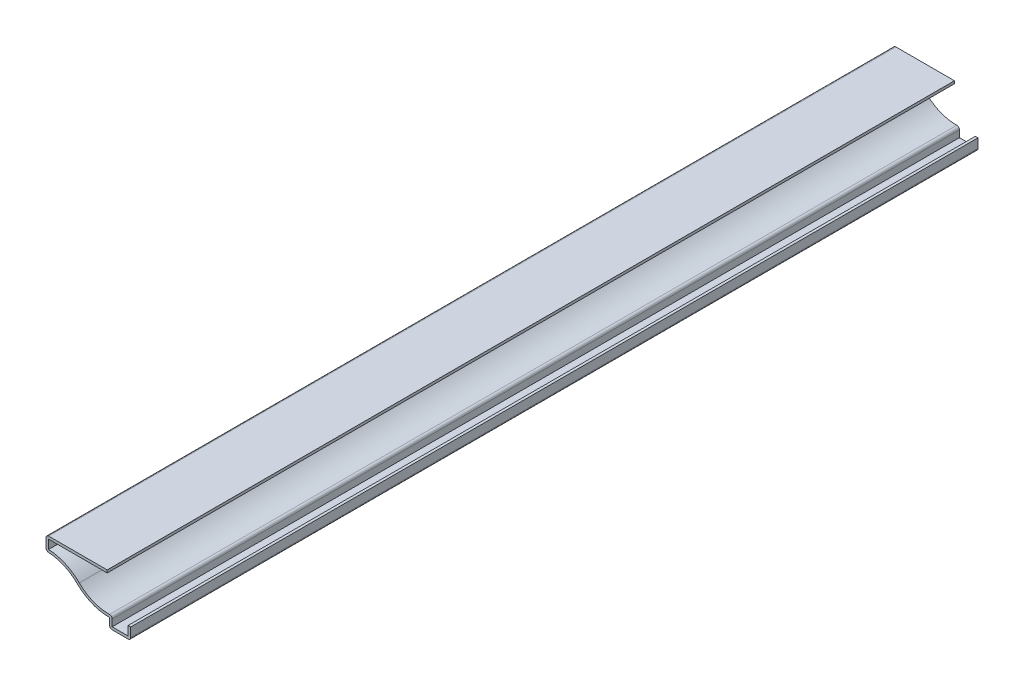
ISO-10303-21;
HEADER;
FILE_DESCRIPTION(('STEP AP214'),'2;1');
FILE_NAME('part.step','',(''),(''),'','','');
FILE_SCHEMA(('AUTOMOTIVE_DESIGN { 1 0 10303 214 1 1 1 1 }'));
ENDSEC;
DATA;
#1=APPLICATION_CONTEXT('core data for automotive mechanical design processes');
#2=APPLICATION_PROTOCOL_DEFINITION('international standard','automotive_design',2000,#1);
#3=PRODUCT_CONTEXT('',#1,'mechanical');
#4=PRODUCT('Part','Part','',(#3));
#5=PRODUCT_RELATED_PRODUCT_CATEGORY('part','',(#4));
#6=PRODUCT_DEFINITION_FORMATION('','',#4);
#7=PRODUCT_DEFINITION_CONTEXT('part definition',#1,'design');
#8=PRODUCT_DEFINITION('design','',#6,#7);
#9=PRODUCT_DEFINITION_SHAPE('','',#8);
#10=(LENGTH_UNIT() NAMED_UNIT(*) SI_UNIT(.MILLI.,.METRE.));
#11=(NAMED_UNIT(*) PLANE_ANGLE_UNIT() SI_UNIT($,.RADIAN.));
#12=(NAMED_UNIT(*) SI_UNIT($,.STERADIAN.) SOLID_ANGLE_UNIT());
#13=UNCERTAINTY_MEASURE_WITH_UNIT(LENGTH_MEASURE(1.E-05),#10,'distance_accuracy_value','');
#14=(GEOMETRIC_REPRESENTATION_CONTEXT(3) GLOBAL_UNCERTAINTY_ASSIGNED_CONTEXT((#13)) GLOBAL_UNIT_ASSIGNED_CONTEXT((#10,
#11,#12)) REPRESENTATION_CONTEXT('',''));
#15=CARTESIAN_POINT('',(0.,0.,0.));
#16=DIRECTION('',(0.,0.,1.));
#17=DIRECTION('',(1.,0.,0.));
#18=AXIS2_PLACEMENT_3D('',#15,#16,#17);
#19=CARTESIAN_POINT('',(-28.575,15.77975,-285.75));
#20=DIRECTION('',(0.,-1.,0.));
#21=DIRECTION('',(1.,0.,0.));
#22=AXIS2_PLACEMENT_3D('',#19,#20,#21);
#23=PLANE('',#22);
#24=DIRECTION('',(1.,0.,0.));
#25=VECTOR('',#24,1.);
#26=CARTESIAN_POINT('',(-28.575,15.77975,0.));
#27=LINE('',#26,#25);
#28=CARTESIAN_POINT('',(-27.686,15.77975,0.));
#29=VERTEX_POINT('',#28);
#30=CARTESIAN_POINT('',(-7.9375,15.77975,0.));
#31=VERTEX_POINT('',#30);
#32=EDGE_CURVE('E242',#29,#31,#27,.T.);
#33=ORIENTED_EDGE('',*,*,#32,.F.);
#34=DIRECTION('',(0.,0.,1.));
#35=VECTOR('',#34,1.);
#36=CARTESIAN_POINT('',(-27.686,15.77975,-285.75));
#37=LINE('',#36,#35);
#38=CARTESIAN_POINT('',(-27.686,15.77975,-285.75));
#39=VERTEX_POINT('',#38);
#40=EDGE_CURVE('E203',#39,#29,#37,.T.);
#41=ORIENTED_EDGE('',*,*,#40,.F.);
#42=DIRECTION('',(1.,0.,0.));
#43=VECTOR('',#42,1.);
#44=CARTESIAN_POINT('',(-28.575,15.77975,-285.75));
#45=LINE('',#44,#43);
#46=CARTESIAN_POINT('',(-7.9375,15.77975,-285.75));
#47=VERTEX_POINT('',#46);
#48=EDGE_CURVE('E185',#39,#47,#45,.T.);
#49=ORIENTED_EDGE('',*,*,#48,.T.);
#50=DIRECTION('',(0.,0.,1.));
#51=VECTOR('',#50,1.);
#52=CARTESIAN_POINT('',(-7.9375,15.77975,-285.75));
#53=LINE('',#52,#51);
#54=EDGE_CURVE('E193',#47,#31,#53,.T.);
#55=ORIENTED_EDGE('',*,*,#54,.T.);
#56=EDGE_LOOP('',(#33,#41,#49,#55));
#57=FACE_BOUND('',#56,.T.);
#58=ADVANCED_FACE('F35',(#57),#23,.T.);
#59=CARTESIAN_POINT('',(-27.686,16.66875,-285.75));
#60=DIRECTION('',(1.,0.,0.));
#61=DIRECTION('',(0.,0.,-1.));
#62=AXIS2_PLACEMENT_3D('',#59,#60,#61);
#63=PLANE('',#62);
#64=DIRECTION('',(0.,1.,0.));
#65=VECTOR('',#64,1.);
#66=CARTESIAN_POINT('',(-27.686,16.66875,0.));
#67=LINE('',#66,#65);
#68=CARTESIAN_POINT('',(-27.686,12.770487263251,0.));
#69=VERTEX_POINT('',#68);
#70=EDGE_CURVE('E204',#69,#29,#67,.T.);
#71=ORIENTED_EDGE('',*,*,#70,.F.);
#72=DIRECTION('',(0.,0.,1.));
#73=VECTOR('',#72,1.);
#74=CARTESIAN_POINT('',(-27.686,12.770487263251,-285.75));
#75=LINE('',#74,#73);
#76=CARTESIAN_POINT('',(-27.686,12.770487263251,-285.75));
#77=VERTEX_POINT('',#76);
#78=EDGE_CURVE('E279',#77,#69,#75,.T.);
#79=ORIENTED_EDGE('',*,*,#78,.F.);
#80=DIRECTION('',(0.,1.,0.));
#81=VECTOR('',#80,1.);
#82=CARTESIAN_POINT('',(-27.686,16.66875,-285.75));
#83=LINE('',#82,#81);
#84=EDGE_CURVE('E201',#77,#39,#83,.T.);
#85=ORIENTED_EDGE('',*,*,#84,.T.);
#86=ORIENTED_EDGE('',*,*,#40,.T.);
#87=EDGE_LOOP('',(#71,#79,#85,#86));
#88=FACE_BOUND('',#87,.T.);
#89=ADVANCED_FACE('F360',(#88),#63,.T.);
#90=CARTESIAN_POINT('',(-28.575,-3.175,-285.75));
#91=DIRECTION('',(0.,0.,1.));
#92=DIRECTION('',(1.,0.,0.));
#93=AXIS2_PLACEMENT_3D('',#90,#91,#92);
#94=CYLINDRICAL_SURFACE('',#93,15.97025);
#95=CARTESIAN_POINT('',(-28.575,-3.175,0.));
#96=DIRECTION('',(0.,0.,1.));
#97=DIRECTION('',(1.,0.,0.));
#98=AXIS2_PLACEMENT_3D('',#95,#96,#97);
#99=CIRCLE('',#98,15.97025);
#100=CARTESIAN_POINT('',(-17.3364565399886,8.1715424671983,0.));
#101=VERTEX_POINT('',#100);
#102=EDGE_CURVE('E207',#101,#69,#99,.T.);
#103=ORIENTED_EDGE('',*,*,#102,.F.);
#104=DIRECTION('',(0.,0.,1.));
#105=VECTOR('',#104,1.);
#106=CARTESIAN_POINT('',(-17.3364565399886,8.1715424671983,-285.75));
#107=LINE('',#106,#105);
#108=CARTESIAN_POINT('',(-17.3364565399886,8.1715424671983,-285.75));
#109=VERTEX_POINT('',#108);
#110=EDGE_CURVE('E281',#109,#101,#107,.T.);
#111=ORIENTED_EDGE('',*,*,#110,.F.);
#112=CARTESIAN_POINT('',(-28.575,-3.175,-285.75));
#113=DIRECTION('',(0.,0.,1.));
#114=DIRECTION('',(1.,0.,0.));
#115=AXIS2_PLACEMENT_3D('',#112,#113,#114);
#116=CIRCLE('',#115,15.97025);
#117=EDGE_CURVE('E238',#109,#77,#116,.T.);
#118=ORIENTED_EDGE('',*,*,#117,.T.);
#119=ORIENTED_EDGE('',*,*,#78,.T.);
#120=EDGE_LOOP('',(#103,#111,#118,#119));
#121=FACE_BOUND('',#120,.T.);
#122=ADVANCED_FACE('F366',(#121),#94,.T.);
#123=CARTESIAN_POINT('',(-7.34912268983927,18.2548515782075,-285.75));
#124=DIRECTION('',(0.,0.,1.));
#125=DIRECTION('',(1.,0.,0.));
#126=AXIS2_PLACEMENT_3D('',#123,#124,#125);
#127=CYLINDRICAL_SURFACE('',#126,14.19225);
#128=CARTESIAN_POINT('',(-7.34912268983927,18.2548515782075,0.));
#129=DIRECTION('',(0.,0.,1.));
#130=DIRECTION('',(1.,0.,0.));
#131=AXIS2_PLACEMENT_3D('',#128,#129,#130);
#132=CIRCLE('',#131,14.19225);
#133=CARTESIAN_POINT('',(-7.15585617961158,4.06391756671539,0.));
#134=VERTEX_POINT('',#133);
#135=EDGE_CURVE('E273',#134,#101,#132,.F.);
#136=ORIENTED_EDGE('',*,*,#135,.F.);
#137=DIRECTION('',(0.,0.,1.));
#138=VECTOR('',#137,1.);
#139=CARTESIAN_POINT('',(-7.15585617961158,4.06391756671539,-285.75));
#140=LINE('',#139,#138);
#141=CARTESIAN_POINT('',(-7.15585617961158,4.06391756671539,-285.75));
#142=VERTEX_POINT('',#141);
#143=EDGE_CURVE('E331',#134,#142,#140,.F.);
#144=ORIENTED_EDGE('',*,*,#143,.T.);
#145=CARTESIAN_POINT('',(-7.34912268983927,18.2548515782075,-285.75));
#146=DIRECTION('',(0.,0.,1.));
#147=DIRECTION('',(1.,0.,0.));
#148=AXIS2_PLACEMENT_3D('',#145,#146,#147);
#149=CIRCLE('',#148,14.19225);
#150=EDGE_CURVE('E236',#142,#109,#149,.F.);
#151=ORIENTED_EDGE('',*,*,#150,.T.);
#152=ORIENTED_EDGE('',*,*,#110,.T.);
#153=EDGE_LOOP('',(#136,#144,#151,#152));
#154=FACE_BOUND('',#153,.T.);
#155=ADVANCED_FACE('F369',(#154),#127,.F.);
#156=CARTESIAN_POINT('',(-6.25475,0.,-285.75));
#157=DIRECTION('',(1.,0.,0.));
#158=DIRECTION('',(0.,1.,0.));
#159=AXIS2_PLACEMENT_3D('',#156,#157,#158);
#160=PLANE('',#159);
#161=DIRECTION('',(0.,1.,0.));
#162=VECTOR('',#161,1.);
#163=CARTESIAN_POINT('',(-6.25475,0.,-285.75));
#164=LINE('',#163,#162);
#165=CARTESIAN_POINT('',(-6.25475,0.888999999999999,-285.75));
#166=VERTEX_POINT('',#165);
#167=CARTESIAN_POINT('',(-6.25475,3.175,-285.75));
#168=VERTEX_POINT('',#167);
#169=EDGE_CURVE('E233',#166,#168,#164,.T.);
#170=ORIENTED_EDGE('',*,*,#169,.T.);
#171=DIRECTION('',(0.,0.,1.));
#172=VECTOR('',#171,1.);
#173=CARTESIAN_POINT('',(-6.25475,3.175,-285.75));
#174=LINE('',#173,#172);
#175=CARTESIAN_POINT('',(-6.25475,3.175,0.));
#176=VERTEX_POINT('',#175);
#177=EDGE_CURVE('E328',#168,#176,#174,.T.);
#178=ORIENTED_EDGE('',*,*,#177,.T.);
#179=DIRECTION('',(0.,1.,0.));
#180=VECTOR('',#179,1.);
#181=CARTESIAN_POINT('',(-6.25475,0.,0.));
#182=LINE('',#181,#180);
#183=CARTESIAN_POINT('',(-6.25475,0.888999999999999,0.));
#184=VERTEX_POINT('',#183);
#185=EDGE_CURVE('E270',#184,#176,#182,.T.);
#186=ORIENTED_EDGE('',*,*,#185,.F.);
#187=DIRECTION('',(0.,0.,1.));
#188=VECTOR('',#187,1.);
#189=CARTESIAN_POINT('',(-6.25475,0.888999999999999,-285.75));
#190=LINE('',#189,#188);
#191=EDGE_CURVE('E284',#166,#184,#190,.T.);
#192=ORIENTED_EDGE('',*,*,#191,.F.);
#193=EDGE_LOOP('',(#170,#178,#186,#192));
#194=FACE_BOUND('',#193,.T.);
#195=ADVANCED_FACE('F377',(#194),#160,.T.);
#196=CARTESIAN_POINT('',(0.,0.889,-285.75));
#197=DIRECTION('',(0.,1.,0.));
#198=DIRECTION('',(-1.,0.,0.));
#199=AXIS2_PLACEMENT_3D('',#196,#197,#198);
#200=PLANE('',#199);
#201=DIRECTION('',(-1.,0.,0.));
#202=VECTOR('',#201,1.);
#203=CARTESIAN_POINT('',(0.,0.889,0.));
#204=LINE('',#203,#202);
#205=CARTESIAN_POINT('',(-0.889,0.889,0.));
#206=VERTEX_POINT('',#205);
#207=EDGE_CURVE('E267',#206,#184,#204,.T.);
#208=ORIENTED_EDGE('',*,*,#207,.F.);
#209=DIRECTION('',(0.,0.,1.));
#210=VECTOR('',#209,1.);
#211=CARTESIAN_POINT('',(-0.889,0.889,-285.75));
#212=LINE('',#211,#210);
#213=CARTESIAN_POINT('',(-0.889,0.889,-285.75));
#214=VERTEX_POINT('',#213);
#215=EDGE_CURVE('E286',#214,#206,#212,.T.);
#216=ORIENTED_EDGE('',*,*,#215,.F.);
#217=DIRECTION('',(-1.,0.,0.));
#218=VECTOR('',#217,1.);
#219=CARTESIAN_POINT('',(0.,0.889,-285.75));
#220=LINE('',#219,#218);
#221=EDGE_CURVE('E230',#214,#166,#220,.T.);
#222=ORIENTED_EDGE('',*,*,#221,.T.);
#223=ORIENTED_EDGE('',*,*,#191,.T.);
#224=EDGE_LOOP('',(#208,#216,#222,#223));
#225=FACE_BOUND('',#224,.T.);
#226=ADVANCED_FACE('F381',(#225),#200,.T.);
#227=CARTESIAN_POINT('',(-0.889,3.96875,-285.75));
#228=DIRECTION('',(-1.,0.,0.));
#229=DIRECTION('',(0.,0.,1.));
#230=AXIS2_PLACEMENT_3D('',#227,#228,#229);
#231=PLANE('',#230);
#232=DIRECTION('',(0.,1.,0.));
#233=VECTOR('',#232,1.);
#234=CARTESIAN_POINT('',(-0.889,3.96875,0.));
#235=LINE('',#234,#233);
#236=CARTESIAN_POINT('',(-0.889,3.96875,0.));
#237=VERTEX_POINT('',#236);
#238=EDGE_CURVE('E264',#237,#206,#235,.F.);
#239=ORIENTED_EDGE('',*,*,#238,.F.);
#240=DIRECTION('',(0.,0.,1.));
#241=VECTOR('',#240,1.);
#242=CARTESIAN_POINT('',(-0.889,3.96875,-285.75));
#243=LINE('',#242,#241);
#244=CARTESIAN_POINT('',(-0.889,3.96875,-285.75));
#245=VERTEX_POINT('',#244);
#246=EDGE_CURVE('E288',#245,#237,#243,.T.);
#247=ORIENTED_EDGE('',*,*,#246,.F.);
#248=DIRECTION('',(0.,1.,0.));
#249=VECTOR('',#248,1.);
#250=CARTESIAN_POINT('',(-0.889,3.96875,-285.75));
#251=LINE('',#250,#249);
#252=EDGE_CURVE('E227',#245,#214,#251,.F.);
#253=ORIENTED_EDGE('',*,*,#252,.T.);
#254=ORIENTED_EDGE('',*,*,#215,.T.);
#255=EDGE_LOOP('',(#239,#247,#253,#254));
#256=FACE_BOUND('',#255,.T.);
#257=ADVANCED_FACE('F385',(#256),#231,.T.);
#258=CARTESIAN_POINT('',(-0.889,3.96875,-285.75));
#259=DIRECTION('',(0.,-1.,0.));
#260=DIRECTION('',(0.,0.,-1.));
#261=AXIS2_PLACEMENT_3D('',#258,#259,#260);
#262=PLANE('',#261);
#263=DIRECTION('',(1.,0.,0.));
#264=VECTOR('',#263,1.);
#265=CARTESIAN_POINT('',(-0.889,3.96875,0.));
#266=LINE('',#265,#264);
#267=CARTESIAN_POINT('',(0.,3.96875,0.));
#268=VERTEX_POINT('',#267);
#269=EDGE_CURVE('E262',#237,#268,#266,.T.);
#270=ORIENTED_EDGE('',*,*,#269,.T.);
#271=DIRECTION('',(0.,0.,1.));
#272=VECTOR('',#271,1.);
#273=CARTESIAN_POINT('',(0.,3.96875,-285.75));
#274=LINE('',#273,#272);
#275=CARTESIAN_POINT('',(0.,3.96875,-285.75));
#276=VERTEX_POINT('',#275);
#277=EDGE_CURVE('E290',#276,#268,#274,.T.);
#278=ORIENTED_EDGE('',*,*,#277,.F.);
#279=DIRECTION('',(1.,0.,0.));
#280=VECTOR('',#279,1.);
#281=CARTESIAN_POINT('',(-0.889,3.96875,-285.75));
#282=LINE('',#281,#280);
#283=EDGE_CURVE('E225',#245,#276,#282,.T.);
#284=ORIENTED_EDGE('',*,*,#283,.F.);
#285=ORIENTED_EDGE('',*,*,#246,.T.);
#286=EDGE_LOOP('',(#270,#278,#284,#285));
#287=FACE_BOUND('',#286,.T.);
#288=ADVANCED_FACE('F390',(#287),#262,.F.);
#289=CARTESIAN_POINT('',(0.,3.96875,-285.75));
#290=DIRECTION('',(-1.,0.,0.));
#291=DIRECTION('',(0.,0.,1.));
#292=AXIS2_PLACEMENT_3D('',#289,#290,#291);
#293=PLANE('',#292);
#294=DIRECTION('',(0.,-1.,0.));
#295=VECTOR('',#294,1.);
#296=CARTESIAN_POINT('',(0.,3.96875,0.));
#297=LINE('',#296,#295);
#298=CARTESIAN_POINT('',(0.,0.889,0.));
#299=VERTEX_POINT('',#298);
#300=EDGE_CURVE('E259',#268,#299,#297,.T.);
#301=ORIENTED_EDGE('',*,*,#300,.T.);
#302=DIRECTION('',(0.,0.,1.));
#303=VECTOR('',#302,1.);
#304=CARTESIAN_POINT('',(0.,0.889,-285.75));
#305=LINE('',#304,#303);
#306=CARTESIAN_POINT('',(0.,0.889,-285.75));
#307=VERTEX_POINT('',#306);
#308=EDGE_CURVE('E314',#299,#307,#305,.F.);
#309=ORIENTED_EDGE('',*,*,#308,.T.);
#310=DIRECTION('',(0.,-1.,0.));
#311=VECTOR('',#310,1.);
#312=CARTESIAN_POINT('',(0.,3.96875,-285.75));
#313=LINE('',#312,#311);
#314=EDGE_CURVE('E223',#276,#307,#313,.T.);
#315=ORIENTED_EDGE('',*,*,#314,.F.);
#316=ORIENTED_EDGE('',*,*,#277,.T.);
#317=EDGE_LOOP('',(#301,#309,#315,#316));
#318=FACE_BOUND('',#317,.T.);
#319=ADVANCED_FACE('F521',(#318),#293,.F.);
#320=CARTESIAN_POINT('',(0.,0.,-285.75));
#321=DIRECTION('',(0.,1.,0.));
#322=DIRECTION('',(-1.,0.,0.));
#323=AXIS2_PLACEMENT_3D('',#320,#321,#322);
#324=PLANE('',#323);
#325=DIRECTION('',(-1.,0.,0.));
#326=VECTOR('',#325,1.);
#327=CARTESIAN_POINT('',(0.,0.,-285.75));
#328=LINE('',#327,#326);
#329=CARTESIAN_POINT('',(-0.889,0.,-285.75));
#330=VERTEX_POINT('',#329);
#331=CARTESIAN_POINT('',(-6.25475,0.,-285.75));
#332=VERTEX_POINT('',#331);
#333=EDGE_CURVE('E220',#330,#332,#328,.T.);
#334=ORIENTED_EDGE('',*,*,#333,.F.);
#335=DIRECTION('',(0.,0.,1.));
#336=VECTOR('',#335,1.);
#337=CARTESIAN_POINT('',(-0.889,0.,-285.75));
#338=LINE('',#337,#336);
#339=CARTESIAN_POINT('',(-0.889,0.,0.));
#340=VERTEX_POINT('',#339);
#341=EDGE_CURVE('E301',#330,#340,#338,.T.);
#342=ORIENTED_EDGE('',*,*,#341,.T.);
#343=DIRECTION('',(-1.,0.,0.));
#344=VECTOR('',#343,1.);
#345=CARTESIAN_POINT('',(0.,0.,0.));
#346=LINE('',#345,#344);
#347=CARTESIAN_POINT('',(-6.25475,0.,0.));
#348=VERTEX_POINT('',#347);
#349=EDGE_CURVE('E256',#340,#348,#346,.T.);
#350=ORIENTED_EDGE('',*,*,#349,.T.);
#351=DIRECTION('',(0.,0.,1.));
#352=VECTOR('',#351,1.);
#353=CARTESIAN_POINT('',(-6.25475,0.,-285.75));
#354=LINE('',#353,#352);
#355=EDGE_CURVE('E278',#348,#332,#354,.F.);
#356=ORIENTED_EDGE('',*,*,#355,.T.);
#357=EDGE_LOOP('',(#334,#342,#350,#356));
#358=FACE_BOUND('',#357,.T.);
#359=ADVANCED_FACE('F400',(#358),#324,.F.);
#360=CARTESIAN_POINT('',(-7.14375,0.,-285.75));
#361=DIRECTION('',(1.,0.,0.));
#362=DIRECTION('',(0.,1.,0.));
#363=AXIS2_PLACEMENT_3D('',#360,#361,#362);
#364=PLANE('',#363);
#365=DIRECTION('',(0.,1.,0.));
#366=VECTOR('',#365,1.);
#367=CARTESIAN_POINT('',(-7.14375,0.,-285.75));
#368=LINE('',#367,#366);
#369=CARTESIAN_POINT('',(-7.14375,0.888999999999999,-285.75));
#370=VERTEX_POINT('',#369);
#371=CARTESIAN_POINT('',(-7.14375,3.175,-285.75));
#372=VERTEX_POINT('',#371);
#373=EDGE_CURVE('E218',#370,#372,#368,.T.);
#374=ORIENTED_EDGE('',*,*,#373,.F.);
#375=DIRECTION('',(0.,0.,1.));
#376=VECTOR('',#375,1.);
#377=CARTESIAN_POINT('',(-7.14375,0.888999999999999,-285.75));
#378=LINE('',#377,#376);
#379=CARTESIAN_POINT('',(-7.14375,0.888999999999999,0.));
#380=VERTEX_POINT('',#379);
#381=EDGE_CURVE('E325',#370,#380,#378,.T.);
#382=ORIENTED_EDGE('',*,*,#381,.T.);
#383=DIRECTION('',(0.,1.,0.));
#384=VECTOR('',#383,1.);
#385=CARTESIAN_POINT('',(-7.14375,0.,0.));
#386=LINE('',#385,#384);
#387=CARTESIAN_POINT('',(-7.14375,3.175,0.));
#388=VERTEX_POINT('',#387);
#389=EDGE_CURVE('E254',#380,#388,#386,.T.);
#390=ORIENTED_EDGE('',*,*,#389,.T.);
#391=DIRECTION('',(0.,0.,1.));
#392=VECTOR('',#391,1.);
#393=CARTESIAN_POINT('',(-7.14375,3.175,-285.75));
#394=LINE('',#393,#392);
#395=EDGE_CURVE('E293',#372,#388,#394,.T.);
#396=ORIENTED_EDGE('',*,*,#395,.F.);
#397=EDGE_LOOP('',(#374,#382,#390,#396));
#398=FACE_BOUND('',#397,.T.);
#399=ADVANCED_FACE('F411',(#398),#364,.F.);
#400=CARTESIAN_POINT('',(-7.34912268983927,18.2548515782075,-285.75));
#401=DIRECTION('',(0.,0.,1.));
#402=DIRECTION('',(1.,0.,0.));
#403=AXIS2_PLACEMENT_3D('',#400,#401,#402);
#404=CYLINDRICAL_SURFACE('',#403,15.08125);
#405=CARTESIAN_POINT('',(-7.34912268983927,18.2548515782075,0.));
#406=DIRECTION('',(0.,0.,-1.));
#407=DIRECTION('',(-1.,0.,0.));
#408=AXIS2_PLACEMENT_3D('',#405,#406,#407);
#409=CIRCLE('',#408,15.08125);
#410=CARTESIAN_POINT('',(-17.9620613449196,7.53992578910376,0.));
#411=VERTEX_POINT('',#410);
#412=EDGE_CURVE('E252',#388,#411,#409,.T.);
#413=ORIENTED_EDGE('',*,*,#412,.T.);
#414=DIRECTION('',(0.,0.,1.));
#415=VECTOR('',#414,1.);
#416=CARTESIAN_POINT('',(-17.9620613449196,7.53992578910376,-285.75));
#417=LINE('',#416,#415);
#418=CARTESIAN_POINT('',(-17.9620613449196,7.53992578910376,-285.75));
#419=VERTEX_POINT('',#418);
#420=EDGE_CURVE('E296',#419,#411,#417,.T.);
#421=ORIENTED_EDGE('',*,*,#420,.F.);
#422=CARTESIAN_POINT('',(-7.34912268983927,18.2548515782075,-285.75));
#423=DIRECTION('',(0.,0.,-1.));
#424=DIRECTION('',(-1.,0.,0.));
#425=AXIS2_PLACEMENT_3D('',#422,#423,#424);
#426=CIRCLE('',#425,15.08125);
#427=EDGE_CURVE('E216',#372,#419,#426,.T.);
#428=ORIENTED_EDGE('',*,*,#427,.F.);
#429=ORIENTED_EDGE('',*,*,#395,.T.);
#430=EDGE_LOOP('',(#413,#421,#428,#429));
#431=FACE_BOUND('',#430,.T.);
#432=ADVANCED_FACE('F414',(#431),#404,.T.);
#433=CARTESIAN_POINT('',(-28.575,-3.175,-285.75));
#434=DIRECTION('',(0.,0.,1.));
#435=DIRECTION('',(1.,0.,0.));
#436=AXIS2_PLACEMENT_3D('',#433,#434,#435);
#437=CYLINDRICAL_SURFACE('',#436,15.08125);
#438=CARTESIAN_POINT('',(-28.575,-3.175,0.));
#439=DIRECTION('',(0.,0.,1.));
#440=DIRECTION('',(1.,0.,0.));
#441=AXIS2_PLACEMENT_3D('',#438,#439,#440);
#442=CIRCLE('',#441,15.08125);
#443=CARTESIAN_POINT('',(-27.7354870775348,11.8828657058533,0.));
#444=VERTEX_POINT('',#443);
#445=EDGE_CURVE('E249',#411,#444,#442,.T.);
#446=ORIENTED_EDGE('',*,*,#445,.T.);
#447=DIRECTION('',(0.,0.,1.));
#448=VECTOR('',#447,1.);
#449=CARTESIAN_POINT('',(-27.7354870775348,11.8828657058533,-285.75));
#450=LINE('',#449,#448);
#451=CARTESIAN_POINT('',(-27.7354870775348,11.8828657058533,-285.75));
#452=VERTEX_POINT('',#451);
#453=EDGE_CURVE('E43',#444,#452,#450,.F.);
#454=ORIENTED_EDGE('',*,*,#453,.T.);
#455=CARTESIAN_POINT('',(-28.575,-3.175,-285.75));
#456=DIRECTION('',(0.,0.,1.));
#457=DIRECTION('',(1.,0.,0.));
#458=AXIS2_PLACEMENT_3D('',#455,#456,#457);
#459=CIRCLE('',#458,15.08125);
#460=EDGE_CURVE('E213',#419,#452,#459,.T.);
#461=ORIENTED_EDGE('',*,*,#460,.F.);
#462=ORIENTED_EDGE('',*,*,#420,.T.);
#463=EDGE_LOOP('',(#446,#454,#461,#462));
#464=FACE_BOUND('',#463,.T.);
#465=ADVANCED_FACE('F339',(#464),#437,.F.);
#466=CARTESIAN_POINT('',(-28.575,16.66875,-285.75));
#467=DIRECTION('',(1.,0.,0.));
#468=DIRECTION('',(0.,0.,-1.));
#469=AXIS2_PLACEMENT_3D('',#466,#467,#468);
#470=PLANE('',#469);
#471=DIRECTION('',(0.,1.,0.));
#472=VECTOR('',#471,1.);
#473=CARTESIAN_POINT('',(-28.575,16.66875,-285.75));
#474=LINE('',#473,#472);
#475=CARTESIAN_POINT('',(-28.575,12.770487263251,-285.75));
#476=VERTEX_POINT('',#475);
#477=CARTESIAN_POINT('',(-28.575,15.77975,-285.75));
#478=VERTEX_POINT('',#477);
#479=EDGE_CURVE('E211',#476,#478,#474,.T.);
#480=ORIENTED_EDGE('',*,*,#479,.F.);
#481=DIRECTION('',(0.,0.,1.));
#482=VECTOR('',#481,1.);
#483=CARTESIAN_POINT('',(-28.575,12.770487263251,-285.75));
#484=LINE('',#483,#482);
#485=CARTESIAN_POINT('',(-28.575,12.770487263251,0.));
#486=VERTEX_POINT('',#485);
#487=EDGE_CURVE('E334',#476,#486,#484,.T.);
#488=ORIENTED_EDGE('',*,*,#487,.T.);
#489=DIRECTION('',(0.,1.,0.));
#490=VECTOR('',#489,1.);
#491=CARTESIAN_POINT('',(-28.575,16.66875,0.));
#492=LINE('',#491,#490);
#493=CARTESIAN_POINT('',(-28.575,15.77975,0.));
#494=VERTEX_POINT('',#493);
#495=EDGE_CURVE('E247',#486,#494,#492,.T.);
#496=ORIENTED_EDGE('',*,*,#495,.T.);
#497=DIRECTION('',(0.,0.,1.));
#498=VECTOR('',#497,1.);
#499=CARTESIAN_POINT('',(-28.575,15.77975,-285.75));
#500=LINE('',#499,#498);
#501=EDGE_CURVE('E58',#494,#478,#500,.F.);
#502=ORIENTED_EDGE('',*,*,#501,.T.);
#503=EDGE_LOOP('',(#480,#488,#496,#502));
#504=FACE_BOUND('',#503,.T.);
#505=ADVANCED_FACE('F348',(#504),#470,.F.);
#506=CARTESIAN_POINT('',(-28.575,16.66875,-285.75));
#507=DIRECTION('',(0.,-1.,0.));
#508=DIRECTION('',(1.,0.,0.));
#509=AXIS2_PLACEMENT_3D('',#506,#507,#508);
#510=PLANE('',#509);
#511=DIRECTION('',(1.,0.,0.));
#512=VECTOR('',#511,1.);
#513=CARTESIAN_POINT('',(-28.575,16.66875,-285.75));
#514=LINE('',#513,#512);
#515=CARTESIAN_POINT('',(-27.686,16.66875,-285.75));
#516=VERTEX_POINT('',#515);
#517=CARTESIAN_POINT('',(-7.9375,16.66875,-285.75));
#518=VERTEX_POINT('',#517);
#519=EDGE_CURVE('E187',#516,#518,#514,.T.);
#520=ORIENTED_EDGE('',*,*,#519,.F.);
#521=DIRECTION('',(0.,0.,1.));
#522=VECTOR('',#521,1.);
#523=CARTESIAN_POINT('',(-27.686,16.66875,-285.75));
#524=LINE('',#523,#522);
#525=CARTESIAN_POINT('',(-27.686,16.66875,0.));
#526=VERTEX_POINT('',#525);
#527=EDGE_CURVE('E11',#516,#526,#524,.T.);
#528=ORIENTED_EDGE('',*,*,#527,.T.);
#529=DIRECTION('',(1.,0.,0.));
#530=VECTOR('',#529,1.);
#531=CARTESIAN_POINT('',(-28.575,16.66875,0.));
#532=LINE('',#531,#530);
#533=CARTESIAN_POINT('',(-7.9375,16.66875,0.));
#534=VERTEX_POINT('',#533);
#535=EDGE_CURVE('E245',#526,#534,#532,.T.);
#536=ORIENTED_EDGE('',*,*,#535,.T.);
#537=DIRECTION('',(0.,0.,1.));
#538=VECTOR('',#537,1.);
#539=CARTESIAN_POINT('',(-7.9375,16.66875,-285.75));
#540=LINE('',#539,#538);
#541=EDGE_CURVE('E200',#518,#534,#540,.T.);
#542=ORIENTED_EDGE('',*,*,#541,.F.);
#543=EDGE_LOOP('',(#520,#528,#536,#542));
#544=FACE_BOUND('',#543,.T.);
#545=ADVANCED_FACE('F356',(#544),#510,.F.);
#546=CARTESIAN_POINT('',(-7.9375,16.66875,-285.75));
#547=DIRECTION('',(-1.,0.,0.));
#548=DIRECTION('',(0.,0.,1.));
#549=AXIS2_PLACEMENT_3D('',#546,#547,#548);
#550=PLANE('',#549);
#551=DIRECTION('',(0.,-1.,0.));
#552=VECTOR('',#551,1.);
#553=CARTESIAN_POINT('',(-7.9375,16.66875,0.));
#554=LINE('',#553,#552);
#555=EDGE_CURVE('E196',#534,#31,#554,.T.);
#556=ORIENTED_EDGE('',*,*,#555,.T.);
#557=ORIENTED_EDGE('',*,*,#54,.F.);
#558=DIRECTION('',(0.,-1.,0.));
#559=VECTOR('',#558,1.);
#560=CARTESIAN_POINT('',(-7.9375,16.66875,-285.75));
#561=LINE('',#560,#559);
#562=EDGE_CURVE('E179',#518,#47,#561,.T.);
#563=ORIENTED_EDGE('',*,*,#562,.F.);
#564=ORIENTED_EDGE('',*,*,#541,.T.);
#565=EDGE_LOOP('',(#556,#557,#563,#564));
#566=FACE_BOUND('',#565,.T.);
#567=ADVANCED_FACE('F194',(#566),#550,.F.);
#568=CARTESIAN_POINT('',(-28.575,-3.175,-285.75));
#569=DIRECTION('',(0.,0.,1.));
#570=DIRECTION('',(1.,0.,0.));
#571=AXIS2_PLACEMENT_3D('',#568,#569,#570);
#572=PLANE('',#571);
#573=ORIENTED_EDGE('',*,*,#314,.T.);
#574=CARTESIAN_POINT('',(-0.889,0.889,-285.75));
#575=DIRECTION('',(0.,0.,1.));
#576=DIRECTION('',(1.,0.,0.));
#577=AXIS2_PLACEMENT_3D('',#574,#575,#576);
#578=CIRCLE('',#577,0.889);
#579=EDGE_CURVE('E323',#307,#330,#578,.F.);
#580=ORIENTED_EDGE('',*,*,#579,.T.);
#581=ORIENTED_EDGE('',*,*,#333,.T.);
#582=CARTESIAN_POINT('',(-6.25475,0.888999999999999,-285.75));
#583=DIRECTION('',(0.,0.,1.));
#584=DIRECTION('',(1.,0.,0.));
#585=AXIS2_PLACEMENT_3D('',#582,#583,#584);
#586=CIRCLE('',#585,0.889);
#587=EDGE_CURVE('E321',#332,#370,#586,.F.);
#588=ORIENTED_EDGE('',*,*,#587,.T.);
#589=ORIENTED_EDGE('',*,*,#373,.T.);
#590=ORIENTED_EDGE('',*,*,#427,.T.);
#591=ORIENTED_EDGE('',*,*,#460,.T.);
#592=CARTESIAN_POINT('',(-27.686,12.770487263251,-285.75));
#593=DIRECTION('',(0.,0.,1.));
#594=DIRECTION('',(1.,0.,0.));
#595=AXIS2_PLACEMENT_3D('',#592,#593,#594);
#596=CIRCLE('',#595,0.889);
#597=EDGE_CURVE('E317',#452,#476,#596,.F.);
#598=ORIENTED_EDGE('',*,*,#597,.T.);
#599=ORIENTED_EDGE('',*,*,#479,.T.);
#600=CARTESIAN_POINT('',(-27.686,15.77975,-285.75));
#601=DIRECTION('',(0.,0.,1.));
#602=DIRECTION('',(1.,0.,0.));
#603=AXIS2_PLACEMENT_3D('',#600,#601,#602);
#604=CIRCLE('',#603,0.889);
#605=EDGE_CURVE('E50',#478,#516,#604,.F.);
#606=ORIENTED_EDGE('',*,*,#605,.T.);
#607=ORIENTED_EDGE('',*,*,#519,.T.);
#608=ORIENTED_EDGE('',*,*,#562,.T.);
#609=ORIENTED_EDGE('',*,*,#48,.F.);
#610=ORIENTED_EDGE('',*,*,#84,.F.);
#611=ORIENTED_EDGE('',*,*,#117,.F.);
#612=ORIENTED_EDGE('',*,*,#150,.F.);
#613=CARTESIAN_POINT('',(-7.14375,3.175,-285.75));
#614=DIRECTION('',(0.,0.,1.));
#615=DIRECTION('',(1.,0.,0.));
#616=AXIS2_PLACEMENT_3D('',#613,#614,#615);
#617=CIRCLE('',#616,0.889);
#618=EDGE_CURVE('E319',#142,#168,#617,.F.);
#619=ORIENTED_EDGE('',*,*,#618,.T.);
#620=ORIENTED_EDGE('',*,*,#169,.F.);
#621=ORIENTED_EDGE('',*,*,#221,.F.);
#622=ORIENTED_EDGE('',*,*,#252,.F.);
#623=ORIENTED_EDGE('',*,*,#283,.T.);
#624=EDGE_LOOP('',(#573,#580,#581,#588,#589,#590,#591,#598,#599,#606,#607,#608,#609,#610,#611,
#612,#619,#620,#621,#622,#623));
#625=FACE_BOUND('',#624,.T.);
#626=ADVANCED_FACE('F182',(#625),#572,.F.);
#627=CARTESIAN_POINT('',(-28.575,-3.175,0.));
#628=DIRECTION('',(0.,0.,1.));
#629=DIRECTION('',(1.,0.,0.));
#630=AXIS2_PLACEMENT_3D('',#627,#628,#629);
#631=PLANE('',#630);
#632=ORIENTED_EDGE('',*,*,#349,.F.);
#633=CARTESIAN_POINT('',(-0.889,0.889,0.));
#634=DIRECTION('',(0.,0.,1.));
#635=DIRECTION('',(1.,0.,0.));
#636=AXIS2_PLACEMENT_3D('',#633,#634,#635);
#637=CIRCLE('',#636,0.889);
#638=EDGE_CURVE('E312',#340,#299,#637,.T.);
#639=ORIENTED_EDGE('',*,*,#638,.T.);
#640=ORIENTED_EDGE('',*,*,#300,.F.);
#641=ORIENTED_EDGE('',*,*,#269,.F.);
#642=ORIENTED_EDGE('',*,*,#238,.T.);
#643=ORIENTED_EDGE('',*,*,#207,.T.);
#644=ORIENTED_EDGE('',*,*,#185,.T.);
#645=CARTESIAN_POINT('',(-7.14375,3.175,0.));
#646=DIRECTION('',(0.,0.,1.));
#647=DIRECTION('',(1.,0.,0.));
#648=AXIS2_PLACEMENT_3D('',#645,#646,#647);
#649=CIRCLE('',#648,0.889);
#650=EDGE_CURVE('E308',#176,#134,#649,.T.);
#651=ORIENTED_EDGE('',*,*,#650,.T.);
#652=ORIENTED_EDGE('',*,*,#135,.T.);
#653=ORIENTED_EDGE('',*,*,#102,.T.);
#654=ORIENTED_EDGE('',*,*,#70,.T.);
#655=ORIENTED_EDGE('',*,*,#32,.T.);
#656=ORIENTED_EDGE('',*,*,#555,.F.);
#657=ORIENTED_EDGE('',*,*,#535,.F.);
#658=CARTESIAN_POINT('',(-27.686,15.77975,0.));
#659=DIRECTION('',(0.,0.,1.));
#660=DIRECTION('',(1.,0.,0.));
#661=AXIS2_PLACEMENT_3D('',#658,#659,#660);
#662=CIRCLE('',#661,0.889);
#663=EDGE_CURVE('E304',#526,#494,#662,.T.);
#664=ORIENTED_EDGE('',*,*,#663,.T.);
#665=ORIENTED_EDGE('',*,*,#495,.F.);
#666=CARTESIAN_POINT('',(-27.686,12.770487263251,0.));
#667=DIRECTION('',(0.,0.,1.));
#668=DIRECTION('',(1.,0.,0.));
#669=AXIS2_PLACEMENT_3D('',#666,#667,#668);
#670=CIRCLE('',#669,0.889);
#671=EDGE_CURVE('E306',#486,#444,#670,.T.);
#672=ORIENTED_EDGE('',*,*,#671,.T.);
#673=ORIENTED_EDGE('',*,*,#445,.F.);
#674=ORIENTED_EDGE('',*,*,#412,.F.);
#675=ORIENTED_EDGE('',*,*,#389,.F.);
#676=CARTESIAN_POINT('',(-6.25475,0.888999999999999,0.));
#677=DIRECTION('',(0.,0.,1.));
#678=DIRECTION('',(1.,0.,0.));
#679=AXIS2_PLACEMENT_3D('',#676,#677,#678);
#680=CIRCLE('',#679,0.889);
#681=EDGE_CURVE('E310',#380,#348,#680,.T.);
#682=ORIENTED_EDGE('',*,*,#681,.T.);
#683=EDGE_LOOP('',(#632,#639,#640,#641,#642,#643,#644,#651,#652,#653,#654,#655,#656,#657,#664,
#665,#672,#673,#674,#675,#682));
#684=FACE_BOUND('',#683,.T.);
#685=ADVANCED_FACE('F351',(#684),#631,.T.);
#686=CARTESIAN_POINT('',(-0.889,0.889,-285.75));
#687=DIRECTION('',(0.,0.,1.));
#688=DIRECTION('',(1.,0.,0.));
#689=AXIS2_PLACEMENT_3D('',#686,#687,#688);
#690=CYLINDRICAL_SURFACE('',#689,0.889);
#691=ORIENTED_EDGE('',*,*,#579,.F.);
#692=ORIENTED_EDGE('',*,*,#308,.F.);
#693=ORIENTED_EDGE('',*,*,#638,.F.);
#694=ORIENTED_EDGE('',*,*,#341,.F.);
#695=EDGE_LOOP('',(#691,#692,#693,#694));
#696=FACE_BOUND('',#695,.T.);
#697=ADVANCED_FACE('F398',(#696),#690,.T.);
#698=CARTESIAN_POINT('',(-6.25475,0.888999999999999,-285.75));
#699=DIRECTION('',(0.,0.,1.));
#700=DIRECTION('',(1.,0.,0.));
#701=AXIS2_PLACEMENT_3D('',#698,#699,#700);
#702=CYLINDRICAL_SURFACE('',#701,0.889);
#703=ORIENTED_EDGE('',*,*,#587,.F.);
#704=ORIENTED_EDGE('',*,*,#355,.F.);
#705=ORIENTED_EDGE('',*,*,#681,.F.);
#706=ORIENTED_EDGE('',*,*,#381,.F.);
#707=EDGE_LOOP('',(#703,#704,#705,#706));
#708=FACE_BOUND('',#707,.T.);
#709=ADVANCED_FACE('F408',(#708),#702,.T.);
#710=CARTESIAN_POINT('',(-7.14375,3.175,-285.75));
#711=DIRECTION('',(0.,0.,1.));
#712=DIRECTION('',(1.,0.,0.));
#713=AXIS2_PLACEMENT_3D('',#710,#711,#712);
#714=CYLINDRICAL_SURFACE('',#713,0.889);
#715=ORIENTED_EDGE('',*,*,#618,.F.);
#716=ORIENTED_EDGE('',*,*,#143,.F.);
#717=ORIENTED_EDGE('',*,*,#650,.F.);
#718=ORIENTED_EDGE('',*,*,#177,.F.);
#719=EDGE_LOOP('',(#715,#716,#717,#718));
#720=FACE_BOUND('',#719,.T.);
#721=ADVANCED_FACE('F372',(#720),#714,.T.);
#722=CARTESIAN_POINT('',(-27.686,12.770487263251,-285.75));
#723=DIRECTION('',(0.,0.,1.));
#724=DIRECTION('',(1.,0.,0.));
#725=AXIS2_PLACEMENT_3D('',#722,#723,#724);
#726=CYLINDRICAL_SURFACE('',#725,0.889);
#727=ORIENTED_EDGE('',*,*,#597,.F.);
#728=ORIENTED_EDGE('',*,*,#453,.F.);
#729=ORIENTED_EDGE('',*,*,#671,.F.);
#730=ORIENTED_EDGE('',*,*,#487,.F.);
#731=EDGE_LOOP('',(#727,#728,#729,#730));
#732=FACE_BOUND('',#731,.T.);
#733=ADVANCED_FACE('F346',(#732),#726,.T.);
#734=CARTESIAN_POINT('',(-27.686,15.77975,-285.75));
#735=DIRECTION('',(0.,0.,1.));
#736=DIRECTION('',(1.,0.,0.));
#737=AXIS2_PLACEMENT_3D('',#734,#735,#736);
#738=CYLINDRICAL_SURFACE('',#737,0.889);
#739=ORIENTED_EDGE('',*,*,#605,.F.);
#740=ORIENTED_EDGE('',*,*,#501,.F.);
#741=ORIENTED_EDGE('',*,*,#663,.F.);
#742=ORIENTED_EDGE('',*,*,#527,.F.);
#743=EDGE_LOOP('',(#739,#740,#741,#742));
#744=FACE_BOUND('',#743,.T.);
#745=ADVANCED_FACE('F37',(#744),#738,.T.);
#746=CLOSED_SHELL('',(#58,#89,#122,#155,#195,#226,#257,#288,#319,#359,#399,#432,#465,#505,#545,
#567,#626,#685,#697,#709,#721,#733,#745));
#747=MANIFOLD_SOLID_BREP('B2',#746);
#748=ADVANCED_BREP_SHAPE_REPRESENTATION('',(#18,#747),#14);
#749=SHAPE_DEFINITION_REPRESENTATION(#9,#748);
ENDSEC;
END-ISO-10303-21;
